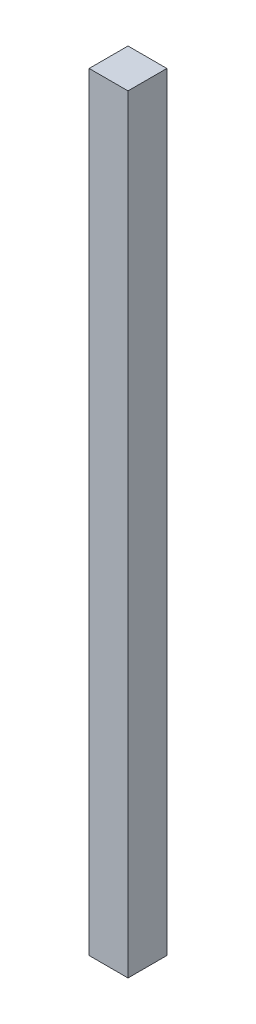
ISO-10303-21;
HEADER;
FILE_DESCRIPTION(('STEP AP214'),'2;1');
FILE_NAME('part.step','',(''),(''),'','','');
FILE_SCHEMA(('AUTOMOTIVE_DESIGN { 1 0 10303 214 1 1 1 1 }'));
ENDSEC;
DATA;
#1=APPLICATION_CONTEXT('core data for automotive mechanical design processes');
#2=APPLICATION_PROTOCOL_DEFINITION('international standard','automotive_design',2000,#1);
#3=PRODUCT_CONTEXT('',#1,'mechanical');
#4=PRODUCT('Part','Part','',(#3));
#5=PRODUCT_RELATED_PRODUCT_CATEGORY('part','',(#4));
#6=PRODUCT_DEFINITION_FORMATION('','',#4);
#7=PRODUCT_DEFINITION_CONTEXT('part definition',#1,'design');
#8=PRODUCT_DEFINITION('design','',#6,#7);
#9=PRODUCT_DEFINITION_SHAPE('','',#8);
#10=(LENGTH_UNIT() NAMED_UNIT(*) SI_UNIT(.MILLI.,.METRE.));
#11=(NAMED_UNIT(*) PLANE_ANGLE_UNIT() SI_UNIT($,.RADIAN.));
#12=(NAMED_UNIT(*) SI_UNIT($,.STERADIAN.) SOLID_ANGLE_UNIT());
#13=UNCERTAINTY_MEASURE_WITH_UNIT(LENGTH_MEASURE(1.E-05),#10,'distance_accuracy_value','');
#14=(GEOMETRIC_REPRESENTATION_CONTEXT(3) GLOBAL_UNCERTAINTY_ASSIGNED_CONTEXT((#13)) GLOBAL_UNIT_ASSIGNED_CONTEXT((#10,
#11,#12)) REPRESENTATION_CONTEXT('',''));
#15=CARTESIAN_POINT('',(0.,0.,0.));
#16=DIRECTION('',(0.,0.,1.));
#17=DIRECTION('',(1.,0.,0.));
#18=AXIS2_PLACEMENT_3D('',#15,#16,#17);
#19=CARTESIAN_POINT('',(-81.3221856725146,77.6388888888889,13.));
#20=DIRECTION('',(0.,1.,0.));
#21=DIRECTION('',(0.,0.,1.));
#22=AXIS2_PLACEMENT_3D('',#19,#20,#21);
#23=PLANE('',#22);
#24=DIRECTION('',(1.,0.,0.));
#25=VECTOR('',#24,1.);
#26=CARTESIAN_POINT('',(-81.3221856725146,77.6388888888889,0.));
#27=LINE('',#26,#25);
#28=CARTESIAN_POINT('',(-81.3221856725146,77.6388888888889,0.));
#29=VERTEX_POINT('',#28);
#30=CARTESIAN_POINT('',(-68.3221856725146,77.6388888888889,0.));
#31=VERTEX_POINT('',#30);
#32=EDGE_CURVE('E98',#29,#31,#27,.T.);
#33=ORIENTED_EDGE('',*,*,#32,.F.);
#34=DIRECTION('',(0.,0.,-1.));
#35=VECTOR('',#34,1.);
#36=CARTESIAN_POINT('',(-81.3221856725146,77.6388888888889,13.));
#37=LINE('',#36,#35);
#38=CARTESIAN_POINT('',(-81.3221856725146,77.6388888888889,13.));
#39=VERTEX_POINT('',#38);
#40=EDGE_CURVE('E11',#39,#29,#37,.T.);
#41=ORIENTED_EDGE('',*,*,#40,.F.);
#42=DIRECTION('',(1.,0.,0.));
#43=VECTOR('',#42,1.);
#44=CARTESIAN_POINT('',(-81.3221856725146,77.6388888888889,13.));
#45=LINE('',#44,#43);
#46=CARTESIAN_POINT('',(-68.3221856725146,77.6388888888889,13.));
#47=VERTEX_POINT('',#46);
#48=EDGE_CURVE('E93',#39,#47,#45,.T.);
#49=ORIENTED_EDGE('',*,*,#48,.T.);
#50=DIRECTION('',(0.,0.,-1.));
#51=VECTOR('',#50,1.);
#52=CARTESIAN_POINT('',(-68.3221856725146,77.6388888888889,13.));
#53=LINE('',#52,#51);
#54=EDGE_CURVE('E36',#47,#31,#53,.T.);
#55=ORIENTED_EDGE('',*,*,#54,.T.);
#56=EDGE_LOOP('',(#33,#41,#49,#55));
#57=FACE_BOUND('',#56,.T.);
#58=ADVANCED_FACE('F33',(#57),#23,.T.);
#59=CARTESIAN_POINT('',(-81.3221856725146,77.6388888888889,13.));
#60=DIRECTION('',(1.,0.,0.));
#61=DIRECTION('',(0.,1.,0.));
#62=AXIS2_PLACEMENT_3D('',#59,#60,#61);
#63=PLANE('',#62);
#64=DIRECTION('',(0.,-1.,0.));
#65=VECTOR('',#64,1.);
#66=CARTESIAN_POINT('',(-81.3221856725146,77.6388888888889,0.));
#67=LINE('',#66,#65);
#68=CARTESIAN_POINT('',(-81.3221856725146,-179.361111111111,0.));
#69=VERTEX_POINT('',#68);
#70=EDGE_CURVE('E66',#29,#69,#67,.T.);
#71=ORIENTED_EDGE('',*,*,#70,.T.);
#72=DIRECTION('',(0.,0.,-1.));
#73=VECTOR('',#72,1.);
#74=CARTESIAN_POINT('',(-81.3221856725146,-179.361111111111,13.));
#75=LINE('',#74,#73);
#76=CARTESIAN_POINT('',(-81.3221856725146,-179.361111111111,13.));
#77=VERTEX_POINT('',#76);
#78=EDGE_CURVE('E42',#77,#69,#75,.T.);
#79=ORIENTED_EDGE('',*,*,#78,.F.);
#80=DIRECTION('',(0.,-1.,0.));
#81=VECTOR('',#80,1.);
#82=CARTESIAN_POINT('',(-81.3221856725146,77.6388888888889,13.));
#83=LINE('',#82,#81);
#84=EDGE_CURVE('E83',#39,#77,#83,.T.);
#85=ORIENTED_EDGE('',*,*,#84,.F.);
#86=ORIENTED_EDGE('',*,*,#40,.T.);
#87=EDGE_LOOP('',(#71,#79,#85,#86));
#88=FACE_BOUND('',#87,.T.);
#89=ADVANCED_FACE('F108',(#88),#63,.F.);
#90=CARTESIAN_POINT('',(-81.3221856725146,-179.361111111111,13.));
#91=DIRECTION('',(0.,1.,0.));
#92=DIRECTION('',(0.,0.,1.));
#93=AXIS2_PLACEMENT_3D('',#90,#91,#92);
#94=PLANE('',#93);
#95=DIRECTION('',(1.,0.,0.));
#96=VECTOR('',#95,1.);
#97=CARTESIAN_POINT('',(-81.3221856725146,-179.361111111111,0.));
#98=LINE('',#97,#96);
#99=CARTESIAN_POINT('',(-68.3221856725146,-179.361111111111,0.));
#100=VERTEX_POINT('',#99);
#101=EDGE_CURVE('E90',#69,#100,#98,.T.);
#102=ORIENTED_EDGE('',*,*,#101,.T.);
#103=DIRECTION('',(0.,0.,-1.));
#104=VECTOR('',#103,1.);
#105=CARTESIAN_POINT('',(-68.3221856725146,-179.361111111111,13.));
#106=LINE('',#105,#104);
#107=CARTESIAN_POINT('',(-68.3221856725146,-179.361111111111,13.));
#108=VERTEX_POINT('',#107);
#109=EDGE_CURVE('E87',#108,#100,#106,.T.);
#110=ORIENTED_EDGE('',*,*,#109,.F.);
#111=DIRECTION('',(1.,0.,0.));
#112=VECTOR('',#111,1.);
#113=CARTESIAN_POINT('',(-81.3221856725146,-179.361111111111,13.));
#114=LINE('',#113,#112);
#115=EDGE_CURVE('E78',#77,#108,#114,.T.);
#116=ORIENTED_EDGE('',*,*,#115,.F.);
#117=ORIENTED_EDGE('',*,*,#78,.T.);
#118=EDGE_LOOP('',(#102,#110,#116,#117));
#119=FACE_BOUND('',#118,.T.);
#120=ADVANCED_FACE('F88',(#119),#94,.F.);
#121=CARTESIAN_POINT('',(-68.3221856725146,77.6388888888889,13.));
#122=DIRECTION('',(1.,0.,0.));
#123=DIRECTION('',(0.,1.,0.));
#124=AXIS2_PLACEMENT_3D('',#121,#122,#123);
#125=PLANE('',#124);
#126=DIRECTION('',(0.,-1.,0.));
#127=VECTOR('',#126,1.);
#128=CARTESIAN_POINT('',(-68.3221856725146,77.6388888888889,0.));
#129=LINE('',#128,#127);
#130=EDGE_CURVE('E101',#31,#100,#129,.T.);
#131=ORIENTED_EDGE('',*,*,#130,.F.);
#132=ORIENTED_EDGE('',*,*,#54,.F.);
#133=DIRECTION('',(0.,-1.,0.));
#134=VECTOR('',#133,1.);
#135=CARTESIAN_POINT('',(-68.3221856725146,77.6388888888889,13.));
#136=LINE('',#135,#134);
#137=EDGE_CURVE('E82',#47,#108,#136,.T.);
#138=ORIENTED_EDGE('',*,*,#137,.T.);
#139=ORIENTED_EDGE('',*,*,#109,.T.);
#140=EDGE_LOOP('',(#131,#132,#138,#139));
#141=FACE_BOUND('',#140,.T.);
#142=ADVANCED_FACE('F92',(#141),#125,.T.);
#143=CARTESIAN_POINT('',(0.,0.,13.));
#144=DIRECTION('',(0.,0.,-1.));
#145=DIRECTION('',(-1.,0.,0.));
#146=AXIS2_PLACEMENT_3D('',#143,#144,#145);
#147=PLANE('',#146);
#148=ORIENTED_EDGE('',*,*,#48,.F.);
#149=ORIENTED_EDGE('',*,*,#84,.T.);
#150=ORIENTED_EDGE('',*,*,#115,.T.);
#151=ORIENTED_EDGE('',*,*,#137,.F.);
#152=EDGE_LOOP('',(#148,#149,#150,#151));
#153=FACE_BOUND('',#152,.T.);
#154=ADVANCED_FACE('F81',(#153),#147,.F.);
#155=CARTESIAN_POINT('',(0.,0.,0.));
#156=DIRECTION('',(0.,0.,-1.));
#157=DIRECTION('',(-1.,0.,0.));
#158=AXIS2_PLACEMENT_3D('',#155,#156,#157);
#159=PLANE('',#158);
#160=ORIENTED_EDGE('',*,*,#32,.T.);
#161=ORIENTED_EDGE('',*,*,#130,.T.);
#162=ORIENTED_EDGE('',*,*,#101,.F.);
#163=ORIENTED_EDGE('',*,*,#70,.F.);
#164=EDGE_LOOP('',(#160,#161,#162,#163));
#165=FACE_BOUND('',#164,.T.);
#166=ADVANCED_FACE('F106',(#165),#159,.T.);
#167=CLOSED_SHELL('',(#58,#89,#120,#142,#154,#166));
#168=MANIFOLD_SOLID_BREP('B2',#167);
#169=ADVANCED_BREP_SHAPE_REPRESENTATION('',(#18,#168),#14);
#170=SHAPE_DEFINITION_REPRESENTATION(#9,#169);
ENDSEC;
END-ISO-10303-21;
